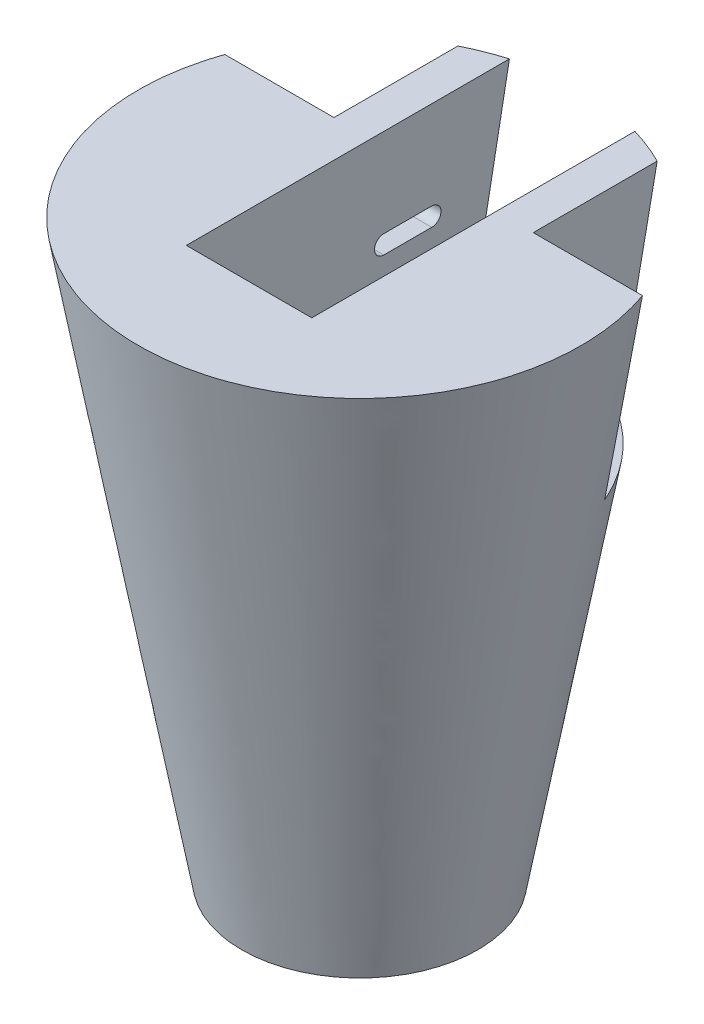
ISO-10303-21;
HEADER;
FILE_DESCRIPTION(('STEP AP214'),'2;1');
FILE_NAME('part.step','',(''),(''),'','','');
FILE_SCHEMA(('AUTOMOTIVE_DESIGN { 1 0 10303 214 1 1 1 1 }'));
ENDSEC;
DATA;
#1=APPLICATION_CONTEXT('core data for automotive mechanical design processes');
#2=APPLICATION_PROTOCOL_DEFINITION('international standard','automotive_design',2000,#1);
#3=PRODUCT_CONTEXT('',#1,'mechanical');
#4=PRODUCT('Part','Part','',(#3));
#5=PRODUCT_RELATED_PRODUCT_CATEGORY('part','',(#4));
#6=PRODUCT_DEFINITION_FORMATION('','',#4);
#7=PRODUCT_DEFINITION_CONTEXT('part definition',#1,'design');
#8=PRODUCT_DEFINITION('design','',#6,#7);
#9=PRODUCT_DEFINITION_SHAPE('','',#8);
#10=(LENGTH_UNIT() NAMED_UNIT(*) SI_UNIT(.MILLI.,.METRE.));
#11=(NAMED_UNIT(*) PLANE_ANGLE_UNIT() SI_UNIT($,.RADIAN.));
#12=(NAMED_UNIT(*) SI_UNIT($,.STERADIAN.) SOLID_ANGLE_UNIT());
#13=UNCERTAINTY_MEASURE_WITH_UNIT(LENGTH_MEASURE(1.E-05),#10,'distance_accuracy_value','');
#14=(GEOMETRIC_REPRESENTATION_CONTEXT(3) GLOBAL_UNCERTAINTY_ASSIGNED_CONTEXT((#13)) GLOBAL_UNIT_ASSIGNED_CONTEXT((#10,
#11,#12)) REPRESENTATION_CONTEXT('',''));
#15=CARTESIAN_POINT('',(0.,0.,0.));
#16=DIRECTION('',(0.,0.,1.));
#17=DIRECTION('',(1.,0.,0.));
#18=AXIS2_PLACEMENT_3D('',#15,#16,#17);
#19=CARTESIAN_POINT('',(0.,77.9,0.));
#20=DIRECTION('',(0.,1.,0.));
#21=DIRECTION('',(0.,0.,1.));
#22=AXIS2_PLACEMENT_3D('',#19,#20,#21);
#23=PLANE('',#22);
#24=DIRECTION('',(-1.,0.,0.));
#25=VECTOR('',#24,1.);
#26=CARTESIAN_POINT('',(13.5,77.9,-10.));
#27=LINE('',#26,#25);
#28=CARTESIAN_POINT('',(28.2842712474619,77.9,-10.0083951407018));
#29=VERTEX_POINT('',#28);
#30=CARTESIAN_POINT('',(13.5,77.9,-10.));
#31=VERTEX_POINT('',#30);
#32=EDGE_CURVE('E247',#29,#31,#27,.T.);
#33=ORIENTED_EDGE('',*,*,#32,.T.);
#34=DIRECTION('',(0.,0.,-1.));
#35=VECTOR('',#34,1.);
#36=CARTESIAN_POINT('',(13.5,77.9,-26.7908566492376));
#37=LINE('',#36,#35);
#38=CARTESIAN_POINT('',(13.5009447320384,77.9,-26.7917724948849));
#39=VERTEX_POINT('',#38);
#40=EDGE_CURVE('E240',#31,#39,#37,.T.);
#41=ORIENTED_EDGE('',*,*,#40,.T.);
#42=CARTESIAN_POINT('',(0.,77.9,0.));
#43=DIRECTION('',(0.,1.,0.));
#44=DIRECTION('',(0.,0.,1.));
#45=AXIS2_PLACEMENT_3D('',#42,#43,#44);
#46=CIRCLE('',#45,30.);
#47=CARTESIAN_POINT('',(8.50024523277648,77.9,-28.7730150824209));
#48=VERTEX_POINT('',#47);
#49=EDGE_CURVE('E456',#39,#48,#46,.T.);
#50=ORIENTED_EDGE('',*,*,#49,.T.);
#51=DIRECTION('',(0.,0.,-1.));
#52=VECTOR('',#51,1.);
#53=CARTESIAN_POINT('',(8.5,77.9,0.));
#54=LINE('',#53,#52);
#55=CARTESIAN_POINT('',(8.50000000000001,77.9,15.));
#56=VERTEX_POINT('',#55);
#57=EDGE_CURVE('E285',#56,#48,#54,.T.);
#58=ORIENTED_EDGE('',*,*,#57,.F.);
#59=DIRECTION('',(1.,0.,0.));
#60=VECTOR('',#59,1.);
#61=CARTESIAN_POINT('',(0.,77.9,15.));
#62=LINE('',#61,#60);
#63=CARTESIAN_POINT('',(-8.50000000000001,77.9,15.));
#64=VERTEX_POINT('',#63);
#65=EDGE_CURVE('E483',#64,#56,#62,.T.);
#66=ORIENTED_EDGE('',*,*,#65,.F.);
#67=DIRECTION('',(0.,0.,1.));
#68=VECTOR('',#67,1.);
#69=CARTESIAN_POINT('',(-8.5,77.9,0.));
#70=LINE('',#69,#68);
#71=CARTESIAN_POINT('',(-8.49999889332075,77.9,-28.7761380600095));
#72=VERTEX_POINT('',#71);
#73=EDGE_CURVE('E288',#72,#64,#70,.T.);
#74=ORIENTED_EDGE('',*,*,#73,.F.);
#75=CARTESIAN_POINT('',(-13.5009447340443,77.9,-26.7917724944871));
#76=VERTEX_POINT('',#75);
#77=EDGE_CURVE('E470',#72,#76,#46,.T.);
#78=ORIENTED_EDGE('',*,*,#77,.T.);
#79=DIRECTION('',(0.,0.,-1.));
#80=VECTOR('',#79,1.);
#81=CARTESIAN_POINT('',(-13.5,77.9,-26.7908566492376));
#82=LINE('',#81,#80);
#83=CARTESIAN_POINT('',(-13.5,77.9,-10.));
#84=VERTEX_POINT('',#83);
#85=EDGE_CURVE('E265',#84,#76,#82,.T.);
#86=ORIENTED_EDGE('',*,*,#85,.F.);
#87=DIRECTION('',(1.,0.,0.));
#88=VECTOR('',#87,1.);
#89=CARTESIAN_POINT('',(-13.5,77.9,-10.));
#90=LINE('',#89,#88);
#91=CARTESIAN_POINT('',(-28.2842712474619,77.9,-10.0083951407018));
#92=VERTEX_POINT('',#91);
#93=EDGE_CURVE('E243',#92,#84,#90,.T.);
#94=ORIENTED_EDGE('',*,*,#93,.F.);
#95=EDGE_CURVE('E459',#92,#29,#46,.T.);
#96=ORIENTED_EDGE('',*,*,#95,.T.);
#97=EDGE_LOOP('',(#33,#41,#50,#58,#66,#74,#78,#86,#94,#96));
#98=FACE_BOUND('',#97,.T.);
#99=ADVANCED_FACE('F57',(#98),#23,.T.);
#100=CARTESIAN_POINT('',(-30.,77.9,0.));
#101=CARTESIAN_POINT('',(-25.3333333333333,51.9333333333333,0.));
#102=CARTESIAN_POINT('',(-20.6666666666667,25.9666666666667,0.));
#103=CARTESIAN_POINT('',(-16.,0.,0.));
#104=CARTESIAN_POINT('',(-30.,77.9,-0.827872514884656));
#105=CARTESIAN_POINT('',(-25.3333333333333,51.9333333333333,-0.699092345902598));
#106=CARTESIAN_POINT('',(-20.6666666666667,25.9666666666667,-0.57031217692054));
#107=CARTESIAN_POINT('',(-16.,0.,-0.441532007938482));
#108=CARTESIAN_POINT('',(-29.9327872514885,77.9,-2.46804304167702));
#109=CARTESIAN_POINT('',(-25.2765759012569,51.9333333333333,-2.08412523519393));
#110=CARTESIAN_POINT('',(-20.6203645510254,25.9666666666667,-1.70020742871084));
#111=CARTESIAN_POINT('',(-15.9641532007938,0.,-1.31628962222774));
#112=CARTESIAN_POINT('',(-29.6380756200167,77.9,-4.8738295861046));
#113=CARTESIAN_POINT('',(-25.0277083013475,51.9333333333333,-4.115678317155));
#114=CARTESIAN_POINT('',(-20.4173409826782,25.9666666666667,-3.35752704820539));
#115=CARTESIAN_POINT('',(-15.8069736640089,0.,-2.59937577925579));
#116=CARTESIAN_POINT('',(-29.1572172166708,77.9,-7.21740114794101));
#117=CARTESIAN_POINT('',(-24.6216500940776,51.9333333333333,-6.09469430270574));
#118=CARTESIAN_POINT('',(-20.0860829714843,25.9666666666667,-4.97198745747047));
#119=CARTESIAN_POINT('',(-15.5505158488911,0.,-3.8492806122352));
#120=CARTESIAN_POINT('',(-25.201660586331,77.9,-20.8590662024313));
#121=CARTESIAN_POINT('',(-21.2814022729017,51.9333333333333,-17.6143225709419));
#122=CARTESIAN_POINT('',(-17.3611439594724,25.9666666666667,-14.3695789394526));
#123=CARTESIAN_POINT('',(-13.4408856460432,0.,-11.1248353079633));
#124=CARTESIAN_POINT('',(-13.2459602381544,77.9,-30.));
#125=CARTESIAN_POINT('',(-11.1854775344415,51.9333333333333,-25.3333333333333));
#126=CARTESIAN_POINT('',(-9.12499483072858,25.9666666666667,-20.6666666666667));
#127=CARTESIAN_POINT('',(-7.06451212701567,0.,-16.));
#128=CARTESIAN_POINT('',(16.557450297693,77.9,-30.));
#129=CARTESIAN_POINT('',(13.9818469180519,51.9333333333333,-25.3333333333333));
#130=CARTESIAN_POINT('',(11.4062435384107,25.9666666666667,-20.6666666666667));
#131=CARTESIAN_POINT('',(8.83064015876961,0.,-16.));
#132=CARTESIAN_POINT('',(30.,77.9,-16.557450297693));
#133=CARTESIAN_POINT('',(25.3333333333333,51.9333333333333,-13.9818469180519));
#134=CARTESIAN_POINT('',(20.6666666666667,25.9666666666667,-11.4062435384107));
#135=CARTESIAN_POINT('',(16.,0.,-8.83064015876959));
#136=CARTESIAN_POINT('',(30.,77.9,16.557450297693));
#137=CARTESIAN_POINT('',(25.3333333333333,51.9333333333333,13.9818469180519));
#138=CARTESIAN_POINT('',(20.6666666666667,25.9666666666667,11.4062435384107));
#139=CARTESIAN_POINT('',(16.,0.,8.8306401587696));
#140=CARTESIAN_POINT('',(16.557450297693,77.9,30.));
#141=CARTESIAN_POINT('',(13.9818469180519,51.9333333333333,25.3333333333333));
#142=CARTESIAN_POINT('',(11.4062435384107,25.9666666666667,20.6666666666667));
#143=CARTESIAN_POINT('',(8.8306401587696,0.,16.));
#144=CARTESIAN_POINT('',(-13.2459602381544,77.9,30.));
#145=CARTESIAN_POINT('',(-11.1854775344415,51.9333333333333,25.3333333333333));
#146=CARTESIAN_POINT('',(-9.12499483072859,25.9666666666667,20.6666666666667));
#147=CARTESIAN_POINT('',(-7.06451212701568,0.,16.));
#148=CARTESIAN_POINT('',(-25.201660586331,77.9,20.8590662024312));
#149=CARTESIAN_POINT('',(-21.2814022729017,51.9333333333333,17.6143225709419));
#150=CARTESIAN_POINT('',(-17.3611439594725,25.9666666666667,14.3695789394526));
#151=CARTESIAN_POINT('',(-13.4408856460432,0.,11.1248353079633));
#152=CARTESIAN_POINT('',(-29.1572172166708,77.9,7.21740114794099));
#153=CARTESIAN_POINT('',(-24.6216500940776,51.9333333333333,6.09469430270573));
#154=CARTESIAN_POINT('',(-20.0860829714843,25.9666666666667,4.97198745747046));
#155=CARTESIAN_POINT('',(-15.5505158488911,0.,3.8492806122352));
#156=CARTESIAN_POINT('',(-29.6380756200167,77.9,4.87382958610458));
#157=CARTESIAN_POINT('',(-25.0277083013475,51.9333333333333,4.11567831715498));
#158=CARTESIAN_POINT('',(-20.4173409826782,25.9666666666667,3.35752704820538));
#159=CARTESIAN_POINT('',(-15.8069736640089,0.,2.59937577925578));
#160=CARTESIAN_POINT('',(-29.9327872514885,77.9,2.46804304167701));
#161=CARTESIAN_POINT('',(-25.2765759012569,51.9333333333333,2.08412523519392));
#162=CARTESIAN_POINT('',(-20.6203645510254,25.9666666666667,1.70020742871083));
#163=CARTESIAN_POINT('',(-15.9641532007938,0.,1.31628962222774));
#164=CARTESIAN_POINT('',(-30.,77.9,0.827872514884639));
#165=CARTESIAN_POINT('',(-25.3333333333333,51.9333333333333,0.699092345902584));
#166=CARTESIAN_POINT('',(-20.6666666666667,25.9666666666667,0.570312176920529));
#167=CARTESIAN_POINT('',(-16.,0.,0.441532007938475));
#168=CARTESIAN_POINT('',(-30.,77.9,0.));
#169=CARTESIAN_POINT('',(-25.3333333333333,51.9333333333333,0.));
#170=CARTESIAN_POINT('',(-20.6666666666667,25.9666666666667,0.));
#171=CARTESIAN_POINT('',(-16.,0.,0.));
#172=B_SPLINE_SURFACE_WITH_KNOTS('',3,3,((#100,#101,#102,#103),(#104,#105,#106,#107),(#108,#109,
#110,#111),(#112,#113,#114,#115),(#116,#117,#118,#119),(#120,#121,#122,#123),(#124,#125,#126,
#127),(#128,#129,#130,#131),(#132,#133,#134,#135),(#136,#137,#138,#139),(#140,#141,#142,#143),
(#144,#145,#146,#147),(#148,#149,#150,#151),(#152,#153,#154,#155),(#156,#157,#158,#159),(#160,
#161,#162,#163),(#164,#165,#166,#167),(#168,#169,#170,#171)),.UNSPECIFIED.,.T.,.F.,.F.,(4,1,1,1,
1,2,2,2,1,1,1,1,4),(4,4),(0.,0.0125,0.0249999999999999,0.0375000000000001,0.05,0.25,0.5,0.75,
0.95,0.9625,0.975,0.9875,1.),(0.,1.),.UNSPECIFIED.);
#173=CARTESIAN_POINT('',(0.,0.,0.));
#174=DIRECTION('',(0.,1.,0.));
#175=DIRECTION('',(0.,0.,1.));
#176=AXIS2_PLACEMENT_3D('',#173,#174,#175);
#177=CIRCLE('',#176,16.);
#178=CARTESIAN_POINT('',(0.,0.,16.));
#179=VERTEX_POINT('',#178);
#180=EDGE_CURVE('E473',#179,#179,#177,.T.);
#181=CARTESIAN_POINT('',(23.1757079220915,51.4,-10.));
#182=CARTESIAN_POINT('',(23.4635256622355,52.8697134305207,-10.));
#183=CARTESIAN_POINT('',(23.7505359860496,54.3395848054901,-10.));
#184=CARTESIAN_POINT('',(24.3230904781029,57.2796108605813,-10.));
#185=CARTESIAN_POINT('',(24.6086346485002,58.7497655402828,-10.));
#186=CARTESIAN_POINT('',(25.178406193689,61.6903291039044,-10.));
#187=CARTESIAN_POINT('',(25.4626335692377,63.1607379876777,-10.));
#188=CARTESIAN_POINT('',(26.0298956190234,66.1017855051841,-10.));
#189=CARTESIAN_POINT('',(26.3129302934721,67.5724241388763,-10.));
#190=CARTESIAN_POINT('',(26.8779178112617,70.5139103109699,-10.));
#191=CARTESIAN_POINT('',(27.1598706537885,71.9847578495277,-10.));
#192=CARTESIAN_POINT('',(27.7227884778144,74.9266438645686,-9.99999999999999));
#193=CARTESIAN_POINT('',(28.0037534580796,76.3976823412879,-9.99999999999997));
#194=CARTESIAN_POINT('',(28.2842712474619,77.8688060202475,-9.99999999999993));
#195=B_SPLINE_CURVE_WITH_KNOTS('',3,(#181,#182,#183,#184,#185,#186,#187,#188,#189,#190,#191,
#192,#193,#194),.UNSPECIFIED.,.F.,.F.,(4,2,2,2,2,2,4),(0.,4.4928905296877,8.98577444374808,
13.4786557739066,17.9715363064835,22.4644202191903,26.9573097417089),.UNSPECIFIED.);
#196=CARTESIAN_POINT('',(23.1757079220915,51.4,-10.));
#197=VERTEX_POINT('',#196);
#198=EDGE_CURVE('E453',#197,#29,#195,.T.);
#199=CARTESIAN_POINT('',(-23.1757079220915,51.4,-10.));
#200=CARTESIAN_POINT('',(-23.4635256622355,52.8697134305207,-10.));
#201=CARTESIAN_POINT('',(-23.7505359860496,54.3395848054901,-10.));
#202=CARTESIAN_POINT('',(-24.3230904781029,57.2796108605813,-10.));
#203=CARTESIAN_POINT('',(-24.6086346485002,58.7497655402828,-10.));
#204=CARTESIAN_POINT('',(-25.178406193689,61.6903291039044,-10.));
#205=CARTESIAN_POINT('',(-25.4626335692377,63.1607379876778,-10.));
#206=CARTESIAN_POINT('',(-26.0298956190234,66.1017855051841,-10.));
#207=CARTESIAN_POINT('',(-26.3129302934721,67.5724241388763,-10.));
#208=CARTESIAN_POINT('',(-26.8779178112617,70.51391031097,-10.));
#209=CARTESIAN_POINT('',(-27.1598706537885,71.9847578495278,-10.));
#210=CARTESIAN_POINT('',(-27.7227884778144,74.9266438645687,-9.99999999999999));
#211=CARTESIAN_POINT('',(-28.0037534580796,76.397682341288,-9.99999999999997));
#212=CARTESIAN_POINT('',(-28.2842712474619,77.8688060202475,-9.99999999999993));
#213=B_SPLINE_CURVE_WITH_KNOTS('',3,(#199,#200,#201,#202,#203,#204,#205,#206,#207,#208,#209,
#210,#211,#212),.UNSPECIFIED.,.F.,.F.,(4,2,2,2,2,2,4),(0.,4.49289052968771,8.9857744437481,
13.4786557739066,17.9715363064835,22.4644202191904,26.9573097417089),.UNSPECIFIED.);
#214=CARTESIAN_POINT('',(-23.1757079220915,51.4,-10.));
#215=VERTEX_POINT('',#214);
#216=EDGE_CURVE('E474',#215,#92,#213,.T.);
#217=CARTESIAN_POINT('',(-23.1757079220915,51.4,-10.));
#218=CARTESIAN_POINT('',(-22.9586497244561,51.4,-10.5019191900079));
#219=CARTESIAN_POINT('',(-22.7251373415485,51.4,-10.9967085213173));
#220=CARTESIAN_POINT('',(-22.2263508154589,51.4,-11.9701313117128));
#221=CARTESIAN_POINT('',(-21.9610706295162,51.4,-12.4487616748294));
#222=CARTESIAN_POINT('',(-21.3999459260929,51.4,-13.3878324961252));
#223=CARTESIAN_POINT('',(-21.1040978390095,51.4,-13.8482708212091));
#224=CARTESIAN_POINT('',(-20.491763925929,51.4,-14.7366081735491));
#225=CARTESIAN_POINT('',(-20.1760711152489,51.4,-15.1650541644655));
#226=CARTESIAN_POINT('',(-19.5184635853431,51.4,-16.0011688750059));
#227=CARTESIAN_POINT('',(-19.176554714696,51.4,-16.4088421952496));
#228=CARTESIAN_POINT('',(-18.4679807072888,51.4,-17.2017764030511));
#229=CARTESIAN_POINT('',(-18.1013262262657,51.4,-17.5870468061811));
#230=CARTESIAN_POINT('',(-17.4046980154609,51.4,-18.2745361075897));
#231=CARTESIAN_POINT('',(-17.0781431558645,51.4,-18.5802291916888));
#232=CARTESIAN_POINT('',(-16.4094425642779,51.4,-19.1738903924221));
#233=CARTESIAN_POINT('',(-16.0673009344364,51.4,-19.4618631263572));
#234=CARTESIAN_POINT('',(-15.3627338082945,51.4,-20.0237649431545));
#235=CARTESIAN_POINT('',(-15.0000724528996,51.4,-20.297398317988));
#236=CARTESIAN_POINT('',(-14.2604693084995,51.4,-20.8248604013042));
#237=CARTESIAN_POINT('',(-13.883523527118,51.4,-21.0786835114276));
#238=CARTESIAN_POINT('',(-13.5,51.4,-21.32215292133));
#239=B_SPLINE_CURVE_WITH_KNOTS('',3,(#217,#218,#219,#220,#221,#222,#223,#224,#225,#226,#227,
#228,#229,#230,#231,#232,#233,#234,#235,#236,#237,#238),.UNSPECIFIED.,.F.,.F.,(4,2,2,2,2,2,2,2,
2,2,4),(0.,1.6402174359253,3.28074736536042,4.92146908660001,6.51699353625294,8.11216306793661,
9.70665003116788,11.0479787229387,12.3889564185561,13.7512332056094,15.1138935870427),.UNSPECIFIED.);
#240=CARTESIAN_POINT('',(-13.5,51.4,-21.32215292133));
#241=VERTEX_POINT('',#240);
#242=EDGE_CURVE('E392',#215,#241,#239,.T.);
#243=CARTESIAN_POINT('',(-13.5,77.8861626938046,-26.7908566492376));
#244=CARTESIAN_POINT('',(-13.5,76.7814595306197,-26.5683921968682));
#245=CARTESIAN_POINT('',(-13.5,75.6768646102556,-26.3453897007897));
#246=CARTESIAN_POINT('',(-13.5,73.4679164883386,-25.8982185863517));
#247=CARTESIAN_POINT('',(-13.5,72.3635632856273,-25.6740499737144));
#248=CARTESIAN_POINT('',(-13.5,70.1551171350946,-25.2244552536031));
#249=CARTESIAN_POINT('',(-13.5,69.0510241863141,-24.9990291508411));
#250=CARTESIAN_POINT('',(-13.5,66.8431198736788,-24.5468147185408));
#251=CARTESIAN_POINT('',(-13.5,65.7393085091879,-24.3200263921086));
#252=CARTESIAN_POINT('',(-13.5,63.5319892963347,-23.8649706820228));
#253=CARTESIAN_POINT('',(-13.5,62.4284814483276,-23.6367032966457));
#254=CARTESIAN_POINT('',(-13.5,60.2217984518958,-23.1785582740477));
#255=CARTESIAN_POINT('',(-13.5,59.1186233039235,-22.948680634647));
#256=CARTESIAN_POINT('',(-13.5,56.9126363533063,-22.4871682714825));
#257=CARTESIAN_POINT('',(-13.5,55.8098245519758,-22.2555335414337));
#258=CARTESIAN_POINT('',(-13.5,53.6046007324064,-21.7903337546608));
#259=CARTESIAN_POINT('',(-13.5,52.5021887168102,-21.556768685411));
#260=CARTESIAN_POINT('',(-13.5,51.4,-21.32215292133));
#261=B_SPLINE_CURVE_WITH_KNOTS('',3,(#243,#244,#245,#246,#247,#248,#249,#250,#251,#252,#253,
#254,#255,#256,#257,#258,#259,#260),.UNSPECIFIED.,.F.,.F.,(4,2,2,2,2,2,2,2,4),(0.,
3.38064132343715,6.76126607307822,10.1418781631339,13.5224825476219,16.9030908722728,
20.2837037744442,23.6643287747413,27.0449757286057),.UNSPECIFIED.);
#262=EDGE_CURVE('E492',#76,#241,#261,.T.);
#263=CARTESIAN_POINT('',(-8.5,51.4,-23.7679793784922));
#264=CARTESIAN_POINT('',(-8.5,52.8717068190027,-24.0489674419024));
#265=CARTESIAN_POINT('',(-8.5,54.3435175312275,-24.3294109532981));
#266=CARTESIAN_POINT('',(-8.5,57.287326651934,-24.8893057148472));
#267=CARTESIAN_POINT('',(-8.5,58.7593250602872,-25.1687569656753));
#268=CARTESIAN_POINT('',(-8.5,61.7034910897063,-25.7267643559056));
#269=CARTESIAN_POINT('',(-8.5,63.1756587107266,-26.005320495548));
#270=CARTESIAN_POINT('',(-8.5,66.1201475437517,-26.5616191192557));
#271=CARTESIAN_POINT('',(-8.5,67.5924687557443,-26.8393616033856));
#272=CARTESIAN_POINT('',(-8.5,70.5372512023908,-27.3941060076321));
#273=CARTESIAN_POINT('',(-8.5,72.0097124370933,-27.6711079274912));
#274=CARTESIAN_POINT('',(-8.5,74.9547632149156,-28.2244335850621));
#275=CARTESIAN_POINT('',(-8.5,76.4273527581094,-28.5007573223804));
#276=CARTESIAN_POINT('',(-8.49999999999999,77.9,-28.7767730471735));
#277=B_SPLINE_CURVE_WITH_KNOTS('',3,(#263,#264,#265,#266,#267,#268,#269,#270,#271,#272,#273,
#274,#275,#276),.UNSPECIFIED.,.F.,.F.,(4,2,2,2,2,2,4),(0.,4.49487211981886,8.98974118294605,
13.4846090398348,17.9794765403342,22.4743456029053,26.9692172730676),.UNSPECIFIED.);
#278=CARTESIAN_POINT('',(-8.5,51.4,-23.7679793784922));
#279=VERTEX_POINT('',#278);
#280=EDGE_CURVE('E338',#279,#72,#277,.T.);
#281=CARTESIAN_POINT('',(-8.50000000000001,51.4,-23.7679793784922));
#282=CARTESIAN_POINT('',(-7.9835933218299,51.4,-23.9529464347679));
#283=CARTESIAN_POINT('',(-7.46109079342121,51.4,-24.1208687416288));
#284=CARTESIAN_POINT('',(-6.40630590082464,51.4,-24.422017638724));
#285=CARTESIAN_POINT('',(-5.87402573819521,51.4,-24.555251939328));
#286=CARTESIAN_POINT('',(-4.8019037049902,51.4,-24.7864932006266));
#287=CARTESIAN_POINT('',(-4.26206237413827,51.4,-24.8845026625244));
#288=CARTESIAN_POINT('',(-3.19479234156453,51.4,-25.042437243245));
#289=CARTESIAN_POINT('',(-2.66753070236044,51.4,-25.103496951989));
#290=CARTESIAN_POINT('',(-1.61020069428057,51.4,-25.1923957707628));
#291=CARTESIAN_POINT('',(-1.08013243440252,51.4,-25.2202361615278));
#292=CARTESIAN_POINT('',(-0.284613864865589,51.4,-25.2372841963799));
#293=CARTESIAN_POINT('',(-0.0193720758511777,51.4,-25.2388481336289));
#294=CARTESIAN_POINT('',(0.511031649653222,51.4,-25.2337698093267));
#295=CARTESIAN_POINT('',(0.776193587523142,51.4,-25.2271276988213));
#296=CARTESIAN_POINT('',(1.48560951843718,51.4,-25.1982816134071));
#297=CARTESIAN_POINT('',(1.92958084490739,51.4,-25.1685866529364));
#298=CARTESIAN_POINT('',(2.81525266895924,51.4,-25.0858531737927));
#299=CARTESIAN_POINT('',(3.25695354063204,51.4,-25.0328186340892));
#300=CARTESIAN_POINT('',(4.13688911590628,51.4,-24.9034246397756));
#301=CARTESIAN_POINT('',(4.5751241352647,51.4,-24.8270673356985));
#302=CARTESIAN_POINT('',(5.45918406127414,51.4,-24.6486824298544));
#303=CARTESIAN_POINT('',(5.90487557199832,51.4,-24.5459929868246));
#304=CARTESIAN_POINT('',(6.79004157287201,51.4,-24.3163334519167));
#305=CARTESIAN_POINT('',(7.2295149494294,51.4,-24.1893590685612));
#306=CARTESIAN_POINT('',(8.10101597357455,51.4,-23.911486886154));
#307=CARTESIAN_POINT('',(8.53304073078554,51.4,-23.7605800220745));
#308=CARTESIAN_POINT('',(8.96059946604544,51.4,-23.5979281073583));
#309=B_SPLINE_CURVE_WITH_KNOTS('',3,(#281,#282,#283,#284,#285,#286,#287,#288,#289,#290,#291,
#292,#293,#294,#295,#296,#297,#298,#299,#300,#301,#302,#303,#304,#305,#306,#307,#308),
.UNSPECIFIED.,.F.,.F.,(4,2,2,2,2,2,2,2,2,2,2,2,2,4),(0.,1.6452894393831,3.29021285480336,
4.93501944638001,6.52635056765848,8.11762033488418,8.91325263612221,9.7088702926748,
11.0431059895868,12.3771143118802,13.7109996657576,15.0824170180009,16.4540769425405,
17.8262576640842),.UNSPECIFIED.);
#310=CARTESIAN_POINT('',(8.49999999997423,51.4,-23.7679793785014));
#311=VERTEX_POINT('',#310);
#312=EDGE_CURVE('E332',#279,#311,#309,.T.);
#313=CARTESIAN_POINT('',(8.5,77.8673034263054,-28.7706447616316));
#314=CARTESIAN_POINT('',(8.5,76.3964735228943,-28.4949649079911));
#315=CARTESIAN_POINT('',(8.5,74.9257012146546,-28.2189776000812));
#316=CARTESIAN_POINT('',(8.5,71.984284661371,-27.6663261038334));
#317=CARTESIAN_POINT('',(8.5,70.5136404162535,-27.3896619158876));
#318=CARTESIAN_POINT('',(8.5,67.5724916685496,-26.8355944646112));
#319=CARTESIAN_POINT('',(8.5,66.101987165915,-26.5581912015369));
#320=CARTESIAN_POINT('',(8.5,63.1611314289135,-26.0025727399522));
#321=CARTESIAN_POINT('',(8.5,61.6907801945588,-25.7243575413775));
#322=CARTESIAN_POINT('',(8.5,58.7502465645902,-25.1670340200989));
#323=CARTESIAN_POINT('',(8.5,57.2800641690217,-24.8879256971557));
#324=CARTESIAN_POINT('',(8.5,54.3398866357395,-24.3287191163873));
#325=CARTESIAN_POINT('',(8.5,52.8698914981535,-24.0486208578902));
#326=CARTESIAN_POINT('',(8.49999999999999,51.4,-23.7679793784922));
#327=B_SPLINE_CURVE_WITH_KNOTS('',3,(#313,#314,#315,#316,#317,#318,#319,#320,#321,#322,#323,
#324,#325,#326),.UNSPECIFIED.,.F.,.F.,(4,2,2,2,2,2,4),(0.,4.48932734316675,8.97865208647571,
13.4679752726186,17.9572988136708,22.4466235575323,26.9359513484791),.UNSPECIFIED.);
#328=CARTESIAN_POINT('',(8.5,77.8673034263054,-28.7706447616316));
#329=VERTEX_POINT('',#328);
#330=EDGE_CURVE('E482',#329,#311,#327,.T.);
#331=CARTESIAN_POINT('',(8.50061810980394,77.9,-28.7765905004633));
#332=CARTESIAN_POINT('',(8.50041207320263,77.8891011421018,-28.7746085875194));
#333=CARTESIAN_POINT('',(8.50020603660131,77.8782022842036,-28.7726266745755));
#334=CARTESIAN_POINT('',(8.5,77.8673034263055,-28.7706447616316));
#335=B_SPLINE_CURVE_WITH_KNOTS('',3,(#331,#332,#333,#334),.UNSPECIFIED.,.F.,.F.,(4,4),(0.,
0.0332385288685757),.UNSPECIFIED.);
#336=EDGE_CURVE('E299',#48,#329,#335,.T.);
#337=CARTESIAN_POINT('',(13.5,77.8861626938046,-26.7908566492376));
#338=CARTESIAN_POINT('',(13.5,76.7814595306197,-26.5683921968682));
#339=CARTESIAN_POINT('',(13.5,75.6768646102556,-26.3453897007897));
#340=CARTESIAN_POINT('',(13.5,73.4679164883386,-25.8982185863517));
#341=CARTESIAN_POINT('',(13.5,72.3635632856273,-25.6740499737144));
#342=CARTESIAN_POINT('',(13.5,70.1551171350946,-25.2244552536031));
#343=CARTESIAN_POINT('',(13.5,69.0510241863141,-24.9990291508411));
#344=CARTESIAN_POINT('',(13.5,66.8431198736788,-24.5468147185408));
#345=CARTESIAN_POINT('',(13.5,65.7393085091879,-24.3200263921086));
#346=CARTESIAN_POINT('',(13.5,63.5319892963347,-23.8649706820228));
#347=CARTESIAN_POINT('',(13.5,62.4284814483276,-23.6367032966457));
#348=CARTESIAN_POINT('',(13.5,60.2217984518958,-23.1785582740477));
#349=CARTESIAN_POINT('',(13.5,59.1186233039235,-22.948680634647));
#350=CARTESIAN_POINT('',(13.5,56.9126363533063,-22.4871682714825));
#351=CARTESIAN_POINT('',(13.5,55.8098245519758,-22.2555335414337));
#352=CARTESIAN_POINT('',(13.5,53.6046007324064,-21.7903337546607));
#353=CARTESIAN_POINT('',(13.5,52.5021887168101,-21.556768685411));
#354=CARTESIAN_POINT('',(13.5,51.4,-21.32215292133));
#355=B_SPLINE_CURVE_WITH_KNOTS('',3,(#337,#338,#339,#340,#341,#342,#343,#344,#345,#346,#347,
#348,#349,#350,#351,#352,#353,#354),.UNSPECIFIED.,.F.,.F.,(4,2,2,2,2,2,2,2,4),(0.,
3.38064132343715,6.76126607307822,10.1418781631339,13.5224825476219,16.9030908722728,
20.2837037744442,23.6643287747413,27.0449757286057),.UNSPECIFIED.);
#356=CARTESIAN_POINT('',(13.5,51.4,-21.32215292133));
#357=VERTEX_POINT('',#356);
#358=EDGE_CURVE('E432',#39,#357,#355,.T.);
#359=CARTESIAN_POINT('',(13.5,51.4,-21.32215292133));
#360=CARTESIAN_POINT('',(13.961527747856,51.4,-21.0291752062862));
#361=CARTESIAN_POINT('',(14.4135200547158,51.4,-20.7211957729273));
#362=CARTESIAN_POINT('',(15.2967895342414,51.4,-20.0765811841946));
#363=CARTESIAN_POINT('',(15.7280606603631,51.4,-19.7399377430112));
#364=CARTESIAN_POINT('',(16.5680361297649,51.4,-19.0394624467794));
#365=CARTESIAN_POINT('',(16.9767371104826,51.4,-18.6756265594257));
#366=CARTESIAN_POINT('',(17.7588721525104,51.4,-17.9327651420386));
#367=CARTESIAN_POINT('',(18.1329684303601,51.4,-17.5544365062577));
#368=CARTESIAN_POINT('',(18.8566098378676,51.4,-16.7751610224936));
#369=CARTESIAN_POINT('',(19.2061610078488,51.4,-16.3742197833666));
#370=CARTESIAN_POINT('',(19.879267503215,51.4,-15.5513566327234));
#371=CARTESIAN_POINT('',(20.2028341596824,51.4,-15.1294439975929));
#372=CARTESIAN_POINT('',(20.773753725857,51.4,-14.3344167723584));
#373=CARTESIAN_POINT('',(21.0250668542356,51.4,-13.9641378051573));
#374=CARTESIAN_POINT('',(21.5076381590563,51.4,-13.2108569002217));
#375=CARTESIAN_POINT('',(21.7389014402241,51.4,-12.8278582354932));
#376=CARTESIAN_POINT('',(22.1842343672248,51.4,-12.0439329618448));
#377=CARTESIAN_POINT('',(22.3979731336954,51.4,-11.6428183511894));
#378=CARTESIAN_POINT('',(22.803502583976,51.4,-10.8294447312209));
#379=CARTESIAN_POINT('',(22.9952844839864,51.4,-10.4171813428273));
#380=CARTESIAN_POINT('',(23.1757079220915,51.4,-10.));
#381=B_SPLINE_CURVE_WITH_KNOTS('',3,(#359,#360,#361,#362,#363,#364,#365,#366,#367,#368,#369,
#370,#371,#372,#373,#374,#375,#376,#377,#378,#379,#380),.UNSPECIFIED.,.F.,.F.,(4,2,2,2,2,2,2,2,
2,2,4),(0.,1.63969566887749,3.27986693881778,4.92028191040163,6.51539797059301,8.11012010172607,
9.70414300201079,11.0460636760827,12.3876416853058,13.7504980204944,15.1138976724541),.UNSPECIFIED.);
#382=EDGE_CURVE('E417',#357,#197,#381,.T.);
#383=ORIENTED_EDGE('',*,*,#180,.T.);
#384=EDGE_LOOP('',(#383));
#385=FACE_BOUND('',#384,.T.);
#386=ORIENTED_EDGE('',*,*,#198,.T.);
#387=ORIENTED_EDGE('',*,*,#95,.F.);
#388=ORIENTED_EDGE('',*,*,#216,.F.);
#389=ORIENTED_EDGE('',*,*,#242,.T.);
#390=ORIENTED_EDGE('',*,*,#262,.F.);
#391=ORIENTED_EDGE('',*,*,#77,.F.);
#392=ORIENTED_EDGE('',*,*,#280,.F.);
#393=ORIENTED_EDGE('',*,*,#312,.T.);
#394=ORIENTED_EDGE('',*,*,#330,.F.);
#395=ORIENTED_EDGE('',*,*,#336,.F.);
#396=ORIENTED_EDGE('',*,*,#49,.F.);
#397=ORIENTED_EDGE('',*,*,#358,.T.);
#398=ORIENTED_EDGE('',*,*,#382,.T.);
#399=EDGE_LOOP('',(#386,#387,#388,#389,#390,#391,#392,#393,#394,#395,#396,#397,#398));
#400=FACE_BOUND('',#399,.T.);
#401=ADVANCED_FACE('F341',(#385,#400),#172,.T.);
#402=CARTESIAN_POINT('',(0.,0.,0.));
#403=DIRECTION('',(0.,1.,0.));
#404=DIRECTION('',(0.,0.,1.));
#405=AXIS2_PLACEMENT_3D('',#402,#403,#404);
#406=PLANE('',#405);
#407=CARTESIAN_POINT('',(0.,0.,0.));
#408=DIRECTION('',(0.,-1.,0.));
#409=DIRECTION('',(0.,0.,-1.));
#410=AXIS2_PLACEMENT_3D('',#407,#408,#409);
#411=CIRCLE('',#410,14.05);
#412=CARTESIAN_POINT('',(0.,0.,-14.05));
#413=VERTEX_POINT('',#412);
#414=EDGE_CURVE('E292',#413,#413,#411,.T.);
#415=ORIENTED_EDGE('',*,*,#414,.F.);
#416=EDGE_LOOP('',(#415));
#417=FACE_BOUND('',#416,.T.);
#418=ORIENTED_EDGE('',*,*,#180,.F.);
#419=EDGE_LOOP('',(#418));
#420=FACE_BOUND('',#419,.T.);
#421=ADVANCED_FACE('F59',(#417,#420),#406,.F.);
#422=CARTESIAN_POINT('',(0.,8.2,0.));
#423=DIRECTION('',(0.,-1.,0.));
#424=DIRECTION('',(0.,0.,-1.));
#425=AXIS2_PLACEMENT_3D('',#422,#423,#424);
#426=CYLINDRICAL_SURFACE('',#425,14.05);
#427=CARTESIAN_POINT('',(0.,8.2,0.));
#428=DIRECTION('',(0.,-1.,0.));
#429=DIRECTION('',(0.,0.,-1.));
#430=AXIS2_PLACEMENT_3D('',#427,#428,#429);
#431=CIRCLE('',#430,14.05);
#432=CARTESIAN_POINT('',(0.,8.2,-14.05));
#433=VERTEX_POINT('',#432);
#434=EDGE_CURVE('E305',#433,#433,#431,.T.);
#435=ORIENTED_EDGE('',*,*,#434,.F.);
#436=EDGE_LOOP('',(#435));
#437=FACE_BOUND('',#436,.T.);
#438=ORIENTED_EDGE('',*,*,#414,.T.);
#439=EDGE_LOOP('',(#438));
#440=FACE_BOUND('',#439,.T.);
#441=ADVANCED_FACE('F542',(#437,#440),#426,.F.);
#442=CARTESIAN_POINT('',(0.,8.2,0.));
#443=DIRECTION('',(0.,-1.,0.));
#444=DIRECTION('',(0.,0.,-1.));
#445=AXIS2_PLACEMENT_3D('',#442,#443,#444);
#446=PLANE('',#445);
#447=ORIENTED_EDGE('',*,*,#434,.T.);
#448=EDGE_LOOP('',(#447));
#449=FACE_BOUND('',#448,.T.);
#450=ADVANCED_FACE('F549',(#449),#446,.T.);
#451=CARTESIAN_POINT('',(-8.5,77.9735315738766,0.));
#452=DIRECTION('',(-1.,0.,0.));
#453=DIRECTION('',(0.,0.,1.));
#454=AXIS2_PLACEMENT_3D('',#451,#452,#453);
#455=PLANE('',#454);
#456=DIRECTION('',(0.,0.,-1.));
#457=VECTOR('',#456,1.);
#458=CARTESIAN_POINT('',(-8.5,65.9,0.));
#459=LINE('',#458,#457);
#460=CARTESIAN_POINT('',(-8.5,65.9,-11.75));
#461=VERTEX_POINT('',#460);
#462=CARTESIAN_POINT('',(-8.5,65.9,-18.25));
#463=VERTEX_POINT('',#462);
#464=EDGE_CURVE('E231',#461,#463,#459,.T.);
#465=ORIENTED_EDGE('',*,*,#464,.T.);
#466=CARTESIAN_POINT('',(-8.5,64.65,-18.25));
#467=DIRECTION('',(-1.,0.,0.));
#468=DIRECTION('',(0.,0.,1.));
#469=AXIS2_PLACEMENT_3D('',#466,#467,#468);
#470=CIRCLE('',#469,1.25);
#471=CARTESIAN_POINT('',(-8.5,63.4,-18.25));
#472=VERTEX_POINT('',#471);
#473=EDGE_CURVE('E237',#463,#472,#470,.T.);
#474=ORIENTED_EDGE('',*,*,#473,.T.);
#475=DIRECTION('',(0.,0.,1.));
#476=VECTOR('',#475,1.);
#477=CARTESIAN_POINT('',(-8.5,63.4,0.));
#478=LINE('',#477,#476);
#479=CARTESIAN_POINT('',(-8.5,63.4,-11.75));
#480=VERTEX_POINT('',#479);
#481=EDGE_CURVE('E222',#472,#480,#478,.T.);
#482=ORIENTED_EDGE('',*,*,#481,.T.);
#483=CARTESIAN_POINT('',(-8.5,64.65,-11.75));
#484=DIRECTION('',(-1.,0.,0.));
#485=DIRECTION('',(0.,0.,1.));
#486=AXIS2_PLACEMENT_3D('',#483,#484,#485);
#487=CIRCLE('',#486,1.25);
#488=EDGE_CURVE('E190',#480,#461,#487,.T.);
#489=ORIENTED_EDGE('',*,*,#488,.T.);
#490=EDGE_LOOP('',(#465,#474,#482,#489));
#491=FACE_BOUND('',#490,.T.);
#492=ORIENTED_EDGE('',*,*,#73,.T.);
#493=DIRECTION('',(0.,-1.,0.));
#494=VECTOR('',#493,1.);
#495=CARTESIAN_POINT('',(-8.50000000000001,77.9735315738766,15.));
#496=LINE('',#495,#494);
#497=CARTESIAN_POINT('',(-8.50000000000001,51.4,15.));
#498=VERTEX_POINT('',#497);
#499=EDGE_CURVE('E283',#64,#498,#496,.T.);
#500=ORIENTED_EDGE('',*,*,#499,.T.);
#501=DIRECTION('',(0.,0.,-1.));
#502=VECTOR('',#501,1.);
#503=CARTESIAN_POINT('',(-8.5,51.4,0.));
#504=LINE('',#503,#502);
#505=EDGE_CURVE('E263',#498,#279,#504,.T.);
#506=ORIENTED_EDGE('',*,*,#505,.T.);
#507=ORIENTED_EDGE('',*,*,#280,.T.);
#508=EDGE_LOOP('',(#492,#500,#506,#507));
#509=FACE_BOUND('',#508,.T.);
#510=ADVANCED_FACE('F518',(#491,#509),#455,.F.);
#511=CARTESIAN_POINT('',(0.,77.9735315738766,15.));
#512=DIRECTION('',(0.,0.,1.));
#513=DIRECTION('',(1.,0.,0.));
#514=AXIS2_PLACEMENT_3D('',#511,#512,#513);
#515=PLANE('',#514);
#516=ORIENTED_EDGE('',*,*,#65,.T.);
#517=DIRECTION('',(0.,-1.,0.));
#518=VECTOR('',#517,1.);
#519=CARTESIAN_POINT('',(8.50000000000001,77.9735315738766,15.));
#520=LINE('',#519,#518);
#521=CARTESIAN_POINT('',(8.50000000000001,51.4,15.));
#522=VERTEX_POINT('',#521);
#523=EDGE_CURVE('E281',#56,#522,#520,.T.);
#524=ORIENTED_EDGE('',*,*,#523,.T.);
#525=DIRECTION('',(-1.,0.,0.));
#526=VECTOR('',#525,1.);
#527=CARTESIAN_POINT('',(0.,51.4,15.));
#528=LINE('',#527,#526);
#529=EDGE_CURVE('E275',#522,#498,#528,.T.);
#530=ORIENTED_EDGE('',*,*,#529,.T.);
#531=ORIENTED_EDGE('',*,*,#499,.F.);
#532=EDGE_LOOP('',(#516,#524,#530,#531));
#533=FACE_BOUND('',#532,.T.);
#534=ADVANCED_FACE('F318',(#533),#515,.F.);
#535=CARTESIAN_POINT('',(8.5,77.9735315738766,0.));
#536=DIRECTION('',(1.,0.,0.));
#537=DIRECTION('',(0.,0.,-1.));
#538=AXIS2_PLACEMENT_3D('',#535,#536,#537);
#539=PLANE('',#538);
#540=DIRECTION('',(0.,0.,-1.));
#541=VECTOR('',#540,1.);
#542=CARTESIAN_POINT('',(8.5,63.4,0.));
#543=LINE('',#542,#541);
#544=CARTESIAN_POINT('',(8.5,63.4,-11.75));
#545=VERTEX_POINT('',#544);
#546=CARTESIAN_POINT('',(8.5,63.4,-18.25));
#547=VERTEX_POINT('',#546);
#548=EDGE_CURVE('E219',#545,#547,#543,.T.);
#549=ORIENTED_EDGE('',*,*,#548,.T.);
#550=CARTESIAN_POINT('',(8.5,64.65,-18.25));
#551=DIRECTION('',(1.,0.,0.));
#552=DIRECTION('',(0.,0.,-1.));
#553=AXIS2_PLACEMENT_3D('',#550,#551,#552);
#554=CIRCLE('',#553,1.25);
#555=CARTESIAN_POINT('',(8.5,65.9,-18.25));
#556=VERTEX_POINT('',#555);
#557=EDGE_CURVE('E234',#547,#556,#554,.T.);
#558=ORIENTED_EDGE('',*,*,#557,.T.);
#559=DIRECTION('',(0.,0.,1.));
#560=VECTOR('',#559,1.);
#561=CARTESIAN_POINT('',(8.5,65.9,0.));
#562=LINE('',#561,#560);
#563=CARTESIAN_POINT('',(8.5,65.9,-11.75));
#564=VERTEX_POINT('',#563);
#565=EDGE_CURVE('E228',#556,#564,#562,.T.);
#566=ORIENTED_EDGE('',*,*,#565,.T.);
#567=CARTESIAN_POINT('',(8.5,64.65,-11.75));
#568=DIRECTION('',(1.,0.,0.));
#569=DIRECTION('',(0.,0.,-1.));
#570=AXIS2_PLACEMENT_3D('',#567,#568,#569);
#571=CIRCLE('',#570,1.25);
#572=EDGE_CURVE('E224',#564,#545,#571,.T.);
#573=ORIENTED_EDGE('',*,*,#572,.T.);
#574=EDGE_LOOP('',(#549,#558,#566,#573));
#575=FACE_BOUND('',#574,.T.);
#576=ORIENTED_EDGE('',*,*,#57,.T.);
#577=ORIENTED_EDGE('',*,*,#336,.T.);
#578=ORIENTED_EDGE('',*,*,#330,.T.);
#579=DIRECTION('',(0.,0.,1.));
#580=VECTOR('',#579,1.);
#581=CARTESIAN_POINT('',(8.5,51.4,0.));
#582=LINE('',#581,#580);
#583=EDGE_CURVE('E278',#311,#522,#582,.T.);
#584=ORIENTED_EDGE('',*,*,#583,.T.);
#585=ORIENTED_EDGE('',*,*,#523,.F.);
#586=EDGE_LOOP('',(#576,#577,#578,#584,#585));
#587=FACE_BOUND('',#586,.T.);
#588=ADVANCED_FACE('F307',(#575,#587),#539,.F.);
#589=CARTESIAN_POINT('',(0.,51.4,0.));
#590=DIRECTION('',(0.,1.,0.));
#591=DIRECTION('',(0.,0.,1.));
#592=AXIS2_PLACEMENT_3D('',#589,#590,#591);
#593=PLANE('',#592);
#594=ORIENTED_EDGE('',*,*,#505,.F.);
#595=ORIENTED_EDGE('',*,*,#529,.F.);
#596=ORIENTED_EDGE('',*,*,#583,.F.);
#597=ORIENTED_EDGE('',*,*,#312,.F.);
#598=EDGE_LOOP('',(#594,#595,#596,#597));
#599=FACE_BOUND('',#598,.T.);
#600=ADVANCED_FACE('F317',(#599),#593,.T.);
#601=CARTESIAN_POINT('',(-13.5,16.9440001041541,-26.7908566492376));
#602=DIRECTION('',(1.,0.,0.));
#603=DIRECTION('',(0.,0.,-1.));
#604=AXIS2_PLACEMENT_3D('',#601,#602,#603);
#605=PLANE('',#604);
#606=DIRECTION('',(0.,0.,1.));
#607=VECTOR('',#606,1.);
#608=CARTESIAN_POINT('',(-13.5,63.4,-18.25));
#609=LINE('',#608,#607);
#610=CARTESIAN_POINT('',(-13.5,63.4,-18.25));
#611=VERTEX_POINT('',#610);
#612=CARTESIAN_POINT('',(-13.5,63.4,-11.75));
#613=VERTEX_POINT('',#612);
#614=EDGE_CURVE('E196',#611,#613,#609,.T.);
#615=ORIENTED_EDGE('',*,*,#614,.F.);
#616=CARTESIAN_POINT('',(-13.5,64.65,-18.25));
#617=DIRECTION('',(-1.,0.,0.));
#618=DIRECTION('',(0.,0.,1.));
#619=AXIS2_PLACEMENT_3D('',#616,#617,#618);
#620=CIRCLE('',#619,1.25);
#621=CARTESIAN_POINT('',(-13.5,65.9,-18.25));
#622=VERTEX_POINT('',#621);
#623=EDGE_CURVE('E202',#622,#611,#620,.T.);
#624=ORIENTED_EDGE('',*,*,#623,.F.);
#625=DIRECTION('',(0.,0.,-1.));
#626=VECTOR('',#625,1.);
#627=CARTESIAN_POINT('',(-13.5,65.9,-18.25));
#628=LINE('',#627,#626);
#629=CARTESIAN_POINT('',(-13.5,65.9,-11.75));
#630=VERTEX_POINT('',#629);
#631=EDGE_CURVE('E207',#630,#622,#628,.T.);
#632=ORIENTED_EDGE('',*,*,#631,.F.);
#633=CARTESIAN_POINT('',(-13.5,64.65,-11.75));
#634=DIRECTION('',(-1.,0.,0.));
#635=DIRECTION('',(0.,0.,1.));
#636=AXIS2_PLACEMENT_3D('',#633,#634,#635);
#637=CIRCLE('',#636,1.25);
#638=EDGE_CURVE('E187',#613,#630,#637,.T.);
#639=ORIENTED_EDGE('',*,*,#638,.F.);
#640=EDGE_LOOP('',(#615,#624,#632,#639));
#641=FACE_BOUND('',#640,.T.);
#642=ORIENTED_EDGE('',*,*,#262,.T.);
#643=DIRECTION('',(0.,0.,1.));
#644=VECTOR('',#643,1.);
#645=CARTESIAN_POINT('',(-13.5,51.4,-26.7908566492376));
#646=LINE('',#645,#644);
#647=CARTESIAN_POINT('',(-13.5,51.4,-10.));
#648=VERTEX_POINT('',#647);
#649=EDGE_CURVE('E260',#241,#648,#646,.T.);
#650=ORIENTED_EDGE('',*,*,#649,.T.);
#651=DIRECTION('',(0.,1.,0.));
#652=VECTOR('',#651,1.);
#653=CARTESIAN_POINT('',(-13.5,16.9440001041541,-10.));
#654=LINE('',#653,#652);
#655=EDGE_CURVE('E261',#648,#84,#654,.T.);
#656=ORIENTED_EDGE('',*,*,#655,.T.);
#657=ORIENTED_EDGE('',*,*,#85,.T.);
#658=EDGE_LOOP('',(#642,#650,#656,#657));
#659=FACE_BOUND('',#658,.T.);
#660=ADVANCED_FACE('F204',(#641,#659),#605,.F.);
#661=CARTESIAN_POINT('',(-13.5,16.9440001041541,-10.));
#662=DIRECTION('',(0.,0.,1.));
#663=DIRECTION('',(1.,0.,0.));
#664=AXIS2_PLACEMENT_3D('',#661,#662,#663);
#665=PLANE('',#664);
#666=ORIENTED_EDGE('',*,*,#216,.T.);
#667=ORIENTED_EDGE('',*,*,#93,.T.);
#668=ORIENTED_EDGE('',*,*,#655,.F.);
#669=DIRECTION('',(-1.,0.,0.));
#670=VECTOR('',#669,1.);
#671=CARTESIAN_POINT('',(-13.5,51.4,-10.));
#672=LINE('',#671,#670);
#673=EDGE_CURVE('E257',#648,#215,#672,.T.);
#674=ORIENTED_EDGE('',*,*,#673,.T.);
#675=EDGE_LOOP('',(#666,#667,#668,#674));
#676=FACE_BOUND('',#675,.T.);
#677=ADVANCED_FACE('F526',(#676),#665,.F.);
#678=CARTESIAN_POINT('',(0.,51.4,0.));
#679=DIRECTION('',(0.,1.,0.));
#680=DIRECTION('',(0.,0.,1.));
#681=AXIS2_PLACEMENT_3D('',#678,#679,#680);
#682=PLANE('',#681);
#683=ORIENTED_EDGE('',*,*,#673,.F.);
#684=ORIENTED_EDGE('',*,*,#649,.F.);
#685=ORIENTED_EDGE('',*,*,#242,.F.);
#686=EDGE_LOOP('',(#683,#684,#685));
#687=FACE_BOUND('',#686,.T.);
#688=ADVANCED_FACE('F445',(#687),#682,.T.);
#689=CARTESIAN_POINT('',(13.5,16.9440001041541,-26.7908566492376));
#690=DIRECTION('',(1.,0.,0.));
#691=DIRECTION('',(0.,0.,-1.));
#692=AXIS2_PLACEMENT_3D('',#689,#690,#691);
#693=PLANE('',#692);
#694=CARTESIAN_POINT('',(13.5,64.65,-18.25));
#695=DIRECTION('',(1.,0.,0.));
#696=DIRECTION('',(0.,0.,-1.));
#697=AXIS2_PLACEMENT_3D('',#694,#695,#696);
#698=CIRCLE('',#697,1.25);
#699=CARTESIAN_POINT('',(13.5,63.4,-18.25));
#700=VERTEX_POINT('',#699);
#701=CARTESIAN_POINT('',(13.5,65.9,-18.25));
#702=VERTEX_POINT('',#701);
#703=EDGE_CURVE('E13',#700,#702,#698,.T.);
#704=ORIENTED_EDGE('',*,*,#703,.F.);
#705=DIRECTION('',(0.,0.,-1.));
#706=VECTOR('',#705,1.);
#707=CARTESIAN_POINT('',(13.5,63.4,-26.7908566492376));
#708=LINE('',#707,#706);
#709=CARTESIAN_POINT('',(13.5,63.4,-11.75));
#710=VERTEX_POINT('',#709);
#711=EDGE_CURVE('E674',#710,#700,#708,.T.);
#712=ORIENTED_EDGE('',*,*,#711,.F.);
#713=CARTESIAN_POINT('',(13.5,64.65,-11.75));
#714=DIRECTION('',(1.,0.,0.));
#715=DIRECTION('',(0.,0.,-1.));
#716=AXIS2_PLACEMENT_3D('',#713,#714,#715);
#717=CIRCLE('',#716,1.25);
#718=CARTESIAN_POINT('',(13.5,65.9,-11.75));
#719=VERTEX_POINT('',#718);
#720=EDGE_CURVE('E676',#719,#710,#717,.T.);
#721=ORIENTED_EDGE('',*,*,#720,.F.);
#722=DIRECTION('',(0.,0.,1.));
#723=VECTOR('',#722,1.);
#724=CARTESIAN_POINT('',(13.5,65.9,-26.7908566492376));
#725=LINE('',#724,#723);
#726=EDGE_CURVE('E66',#702,#719,#725,.T.);
#727=ORIENTED_EDGE('',*,*,#726,.F.);
#728=EDGE_LOOP('',(#704,#712,#721,#727));
#729=FACE_BOUND('',#728,.T.);
#730=ORIENTED_EDGE('',*,*,#40,.F.);
#731=DIRECTION('',(0.,1.,0.));
#732=VECTOR('',#731,1.);
#733=CARTESIAN_POINT('',(13.5,16.9440001041541,-10.));
#734=LINE('',#733,#732);
#735=CARTESIAN_POINT('',(13.5,51.4,-10.));
#736=VERTEX_POINT('',#735);
#737=EDGE_CURVE('E245',#736,#31,#734,.T.);
#738=ORIENTED_EDGE('',*,*,#737,.F.);
#739=DIRECTION('',(0.,0.,1.));
#740=VECTOR('',#739,1.);
#741=CARTESIAN_POINT('',(13.5,51.4,-26.7908566492376));
#742=LINE('',#741,#740);
#743=EDGE_CURVE('E244',#357,#736,#742,.T.);
#744=ORIENTED_EDGE('',*,*,#743,.F.);
#745=ORIENTED_EDGE('',*,*,#358,.F.);
#746=EDGE_LOOP('',(#730,#738,#744,#745));
#747=FACE_BOUND('',#746,.T.);
#748=ADVANCED_FACE('F439',(#729,#747),#693,.T.);
#749=CARTESIAN_POINT('',(13.5,16.9440001041541,-10.));
#750=DIRECTION('',(0.,0.,-1.));
#751=DIRECTION('',(-1.,0.,0.));
#752=AXIS2_PLACEMENT_3D('',#749,#750,#751);
#753=PLANE('',#752);
#754=DIRECTION('',(1.,0.,0.));
#755=VECTOR('',#754,1.);
#756=CARTESIAN_POINT('',(13.5,51.4,-10.));
#757=LINE('',#756,#755);
#758=EDGE_CURVE('E241',#736,#197,#757,.T.);
#759=ORIENTED_EDGE('',*,*,#758,.F.);
#760=ORIENTED_EDGE('',*,*,#737,.T.);
#761=ORIENTED_EDGE('',*,*,#32,.F.);
#762=ORIENTED_EDGE('',*,*,#198,.F.);
#763=EDGE_LOOP('',(#759,#760,#761,#762));
#764=FACE_BOUND('',#763,.T.);
#765=ADVANCED_FACE('F434',(#764),#753,.T.);
#766=CARTESIAN_POINT('',(0.,51.4,0.));
#767=DIRECTION('',(0.,1.,0.));
#768=DIRECTION('',(0.,0.,1.));
#769=AXIS2_PLACEMENT_3D('',#766,#767,#768);
#770=PLANE('',#769);
#771=ORIENTED_EDGE('',*,*,#743,.T.);
#772=ORIENTED_EDGE('',*,*,#758,.T.);
#773=ORIENTED_EDGE('',*,*,#382,.F.);
#774=EDGE_LOOP('',(#771,#772,#773));
#775=FACE_BOUND('',#774,.T.);
#776=ADVANCED_FACE('F438',(#775),#770,.T.);
#777=CARTESIAN_POINT('',(30.0736583928815,63.4,-18.25));
#778=DIRECTION('',(0.,-1.,0.));
#779=DIRECTION('',(0.,0.,-1.));
#780=AXIS2_PLACEMENT_3D('',#777,#778,#779);
#781=PLANE('',#780);
#782=DIRECTION('',(-1.,0.,0.));
#783=VECTOR('',#782,1.);
#784=CARTESIAN_POINT('',(30.0736583928815,63.4,-11.75));
#785=LINE('',#784,#783);
#786=EDGE_CURVE('E192',#710,#545,#785,.T.);
#787=ORIENTED_EDGE('',*,*,#786,.F.);
#788=ORIENTED_EDGE('',*,*,#711,.T.);
#789=DIRECTION('',(-1.,0.,0.));
#790=VECTOR('',#789,1.);
#791=CARTESIAN_POINT('',(30.0736583928815,63.4,-18.25));
#792=LINE('',#791,#790);
#793=EDGE_CURVE('E81',#700,#547,#792,.T.);
#794=ORIENTED_EDGE('',*,*,#793,.T.);
#795=ORIENTED_EDGE('',*,*,#548,.F.);
#796=EDGE_LOOP('',(#787,#788,#794,#795));
#797=FACE_BOUND('',#796,.T.);
#798=ADVANCED_FACE('F596',(#797),#781,.F.);
#799=CARTESIAN_POINT('',(30.0736583928815,64.65,-11.75));
#800=DIRECTION('',(-1.,0.,0.));
#801=DIRECTION('',(0.,0.,1.));
#802=AXIS2_PLACEMENT_3D('',#799,#800,#801);
#803=CYLINDRICAL_SURFACE('',#802,1.25);
#804=DIRECTION('',(-1.,0.,0.));
#805=VECTOR('',#804,1.);
#806=CARTESIAN_POINT('',(30.0736583928815,65.9,-11.75));
#807=LINE('',#806,#805);
#808=EDGE_CURVE('E215',#719,#564,#807,.T.);
#809=ORIENTED_EDGE('',*,*,#808,.F.);
#810=ORIENTED_EDGE('',*,*,#720,.T.);
#811=ORIENTED_EDGE('',*,*,#786,.T.);
#812=ORIENTED_EDGE('',*,*,#572,.F.);
#813=EDGE_LOOP('',(#809,#810,#811,#812));
#814=FACE_BOUND('',#813,.T.);
#815=ADVANCED_FACE('F601',(#814),#803,.F.);
#816=CARTESIAN_POINT('',(30.0736583928815,65.9,-18.25));
#817=DIRECTION('',(0.,1.,0.));
#818=DIRECTION('',(0.,0.,1.));
#819=AXIS2_PLACEMENT_3D('',#816,#817,#818);
#820=PLANE('',#819);
#821=DIRECTION('',(-1.,0.,0.));
#822=VECTOR('',#821,1.);
#823=CARTESIAN_POINT('',(30.0736583928815,65.9,-18.25));
#824=LINE('',#823,#822);
#825=EDGE_CURVE('E214',#702,#556,#824,.T.);
#826=ORIENTED_EDGE('',*,*,#825,.F.);
#827=ORIENTED_EDGE('',*,*,#726,.T.);
#828=ORIENTED_EDGE('',*,*,#808,.T.);
#829=ORIENTED_EDGE('',*,*,#565,.F.);
#830=EDGE_LOOP('',(#826,#827,#828,#829));
#831=FACE_BOUND('',#830,.T.);
#832=ADVANCED_FACE('F612',(#831),#820,.F.);
#833=CARTESIAN_POINT('',(30.0736583928815,64.65,-18.25));
#834=DIRECTION('',(-1.,0.,0.));
#835=DIRECTION('',(0.,0.,1.));
#836=AXIS2_PLACEMENT_3D('',#833,#834,#835);
#837=CYLINDRICAL_SURFACE('',#836,1.25);
#838=ORIENTED_EDGE('',*,*,#793,.F.);
#839=ORIENTED_EDGE('',*,*,#703,.T.);
#840=ORIENTED_EDGE('',*,*,#825,.T.);
#841=ORIENTED_EDGE('',*,*,#557,.F.);
#842=EDGE_LOOP('',(#838,#839,#840,#841));
#843=FACE_BOUND('',#842,.T.);
#844=ADVANCED_FACE('F622',(#843),#837,.F.);
#845=EDGE_CURVE('E212',#463,#622,#824,.T.);
#846=ORIENTED_EDGE('',*,*,#845,.T.);
#847=ORIENTED_EDGE('',*,*,#623,.T.);
#848=EDGE_CURVE('E199',#472,#611,#792,.T.);
#849=ORIENTED_EDGE('',*,*,#848,.F.);
#850=ORIENTED_EDGE('',*,*,#473,.F.);
#851=EDGE_LOOP('',(#846,#847,#849,#850));
#852=FACE_BOUND('',#851,.T.);
#853=ADVANCED_FACE('F633',(#852),#837,.F.);
#854=EDGE_CURVE('E216',#461,#630,#807,.T.);
#855=ORIENTED_EDGE('',*,*,#854,.T.);
#856=ORIENTED_EDGE('',*,*,#631,.T.);
#857=ORIENTED_EDGE('',*,*,#845,.F.);
#858=ORIENTED_EDGE('',*,*,#464,.F.);
#859=EDGE_LOOP('',(#855,#856,#857,#858));
#860=FACE_BOUND('',#859,.T.);
#861=ADVANCED_FACE('F625',(#860),#820,.F.);
#862=EDGE_CURVE('E73',#480,#613,#785,.T.);
#863=ORIENTED_EDGE('',*,*,#862,.T.);
#864=ORIENTED_EDGE('',*,*,#638,.T.);
#865=ORIENTED_EDGE('',*,*,#854,.F.);
#866=ORIENTED_EDGE('',*,*,#488,.F.);
#867=EDGE_LOOP('',(#863,#864,#865,#866));
#868=FACE_BOUND('',#867,.T.);
#869=ADVANCED_FACE('F184',(#868),#803,.F.);
#870=ORIENTED_EDGE('',*,*,#848,.T.);
#871=ORIENTED_EDGE('',*,*,#614,.T.);
#872=ORIENTED_EDGE('',*,*,#862,.F.);
#873=ORIENTED_EDGE('',*,*,#481,.F.);
#874=EDGE_LOOP('',(#870,#871,#872,#873));
#875=FACE_BOUND('',#874,.T.);
#876=ADVANCED_FACE('F197',(#875),#781,.F.);
#877=CLOSED_SHELL('',(#99,#401,#421,#441,#450,#510,#534,#588,#600,#660,#677,#688,#748,#765,#776,
#798,#815,#832,#844,#853,#861,#869,#876));
#878=MANIFOLD_SOLID_BREP('B2',#877);
#879=ADVANCED_BREP_SHAPE_REPRESENTATION('',(#18,#878),#14);
#880=SHAPE_DEFINITION_REPRESENTATION(#9,#879);
ENDSEC;
END-ISO-10303-21;
